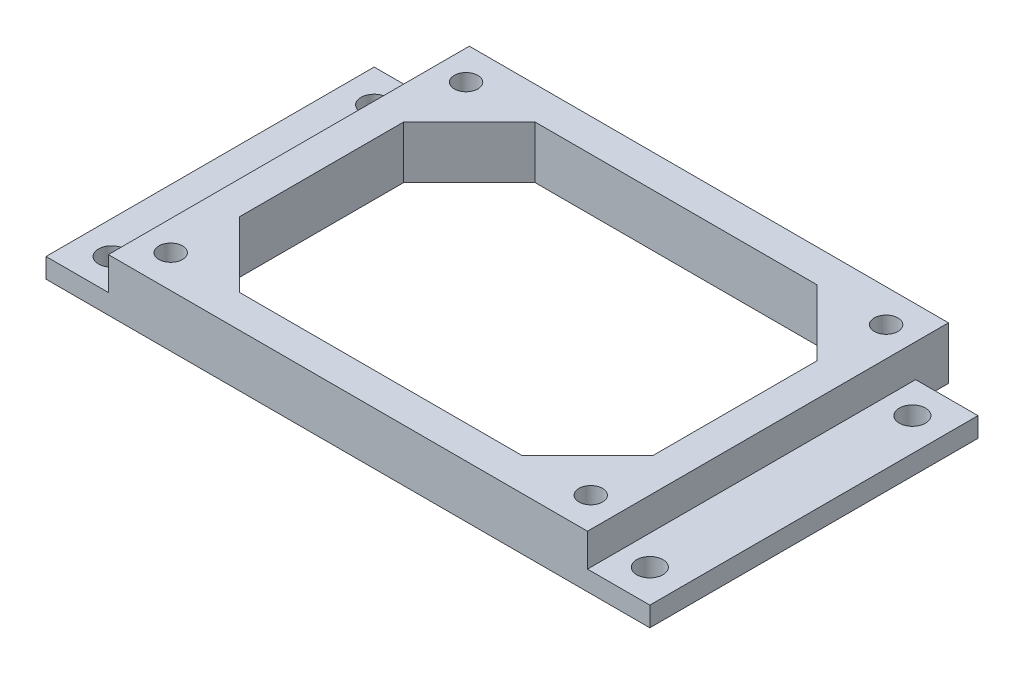
ISO-10303-21;
HEADER;
FILE_DESCRIPTION(('STEP AP214'),'2;1');
FILE_NAME('part.step','',(''),(''),'','','');
FILE_SCHEMA(('AUTOMOTIVE_DESIGN { 1 0 10303 214 1 1 1 1 }'));
ENDSEC;
DATA;
#1=APPLICATION_CONTEXT('core data for automotive mechanical design processes');
#2=APPLICATION_PROTOCOL_DEFINITION('international standard','automotive_design',2000,#1);
#3=PRODUCT_CONTEXT('',#1,'mechanical');
#4=PRODUCT('Part','Part','',(#3));
#5=PRODUCT_RELATED_PRODUCT_CATEGORY('part','',(#4));
#6=PRODUCT_DEFINITION_FORMATION('','',#4);
#7=PRODUCT_DEFINITION_CONTEXT('part definition',#1,'design');
#8=PRODUCT_DEFINITION('design','',#6,#7);
#9=PRODUCT_DEFINITION_SHAPE('','',#8);
#10=(LENGTH_UNIT() NAMED_UNIT(*) SI_UNIT(.MILLI.,.METRE.));
#11=(NAMED_UNIT(*) PLANE_ANGLE_UNIT() SI_UNIT($,.RADIAN.));
#12=(NAMED_UNIT(*) SI_UNIT($,.STERADIAN.) SOLID_ANGLE_UNIT());
#13=UNCERTAINTY_MEASURE_WITH_UNIT(LENGTH_MEASURE(1.E-05),#10,'distance_accuracy_value','');
#14=(GEOMETRIC_REPRESENTATION_CONTEXT(3) GLOBAL_UNCERTAINTY_ASSIGNED_CONTEXT((#13)) GLOBAL_UNIT_ASSIGNED_CONTEXT((#10,
#11,#12)) REPRESENTATION_CONTEXT('',''));
#15=CARTESIAN_POINT('',(0.,0.,0.));
#16=DIRECTION('',(0.,0.,1.));
#17=DIRECTION('',(1.,0.,0.));
#18=AXIS2_PLACEMENT_3D('',#15,#16,#17);
#19=CARTESIAN_POINT('',(-36.5,5.,-25.));
#20=DIRECTION('',(0.,0.,1.));
#21=DIRECTION('',(1.,0.,0.));
#22=AXIS2_PLACEMENT_3D('',#19,#20,#21);
#23=PLANE('',#22);
#24=DIRECTION('',(0.,-1.,0.));
#25=VECTOR('',#24,1.);
#26=CARTESIAN_POINT('',(36.5,5.,-25.));
#27=LINE('',#26,#25);
#28=CARTESIAN_POINT('',(36.5,0.,-25.));
#29=VERTEX_POINT('',#28);
#30=CARTESIAN_POINT('',(36.5,-3.,-25.));
#31=VERTEX_POINT('',#30);
#32=EDGE_CURVE('E11',#29,#31,#27,.T.);
#33=ORIENTED_EDGE('',*,*,#32,.F.);
#34=DIRECTION('',(1.,0.,0.));
#35=VECTOR('',#34,1.);
#36=CARTESIAN_POINT('',(-46.,0.,-25.));
#37=LINE('',#36,#35);
#38=CARTESIAN_POINT('',(46.,0.,-25.));
#39=VERTEX_POINT('',#38);
#40=EDGE_CURVE('E350',#29,#39,#37,.T.);
#41=ORIENTED_EDGE('',*,*,#40,.T.);
#42=DIRECTION('',(0.,1.,0.));
#43=VECTOR('',#42,1.);
#44=CARTESIAN_POINT('',(46.,-3.,-25.));
#45=LINE('',#44,#43);
#46=CARTESIAN_POINT('',(46.,-3.,-25.));
#47=VERTEX_POINT('',#46);
#48=EDGE_CURVE('E337',#47,#39,#45,.T.);
#49=ORIENTED_EDGE('',*,*,#48,.F.);
#50=DIRECTION('',(1.,0.,0.));
#51=VECTOR('',#50,1.);
#52=CARTESIAN_POINT('',(-46.,-3.,-25.));
#53=LINE('',#52,#51);
#54=EDGE_CURVE('E332',#31,#47,#53,.T.);
#55=ORIENTED_EDGE('',*,*,#54,.F.);
#56=EDGE_LOOP('',(#33,#41,#49,#55));
#57=FACE_BOUND('',#56,.T.);
#58=ADVANCED_FACE('F38',(#57),#23,.F.);
#59=DIRECTION('',(0.,1.,0.));
#60=VECTOR('',#59,1.);
#61=CARTESIAN_POINT('',(-36.5,5.,-25.));
#62=LINE('',#61,#60);
#63=CARTESIAN_POINT('',(-36.5,-3.,-25.));
#64=VERTEX_POINT('',#63);
#65=CARTESIAN_POINT('',(-36.5,0.,-25.));
#66=VERTEX_POINT('',#65);
#67=EDGE_CURVE('E281',#64,#66,#62,.T.);
#68=ORIENTED_EDGE('',*,*,#67,.F.);
#69=CARTESIAN_POINT('',(-46.,-3.,-25.));
#70=VERTEX_POINT('',#69);
#71=EDGE_CURVE('E333',#70,#64,#53,.T.);
#72=ORIENTED_EDGE('',*,*,#71,.F.);
#73=DIRECTION('',(0.,1.,0.));
#74=VECTOR('',#73,1.);
#75=CARTESIAN_POINT('',(-46.,-3.,-25.));
#76=LINE('',#75,#74);
#77=CARTESIAN_POINT('',(-46.,0.,-25.));
#78=VERTEX_POINT('',#77);
#79=EDGE_CURVE('E357',#70,#78,#76,.T.);
#80=ORIENTED_EDGE('',*,*,#79,.T.);
#81=EDGE_CURVE('E326',#78,#66,#37,.T.);
#82=ORIENTED_EDGE('',*,*,#81,.T.);
#83=EDGE_LOOP('',(#68,#72,#80,#82));
#84=FACE_BOUND('',#83,.T.);
#85=ADVANCED_FACE('F432',(#84),#23,.F.);
#86=CARTESIAN_POINT('',(36.5,5.,25.));
#87=DIRECTION('',(-1.,0.,0.));
#88=DIRECTION('',(0.,0.,1.));
#89=AXIS2_PLACEMENT_3D('',#86,#87,#88);
#90=PLANE('',#89);
#91=DIRECTION('',(0.,0.,-1.));
#92=VECTOR('',#91,1.);
#93=CARTESIAN_POINT('',(36.5,0.,25.));
#94=LINE('',#93,#92);
#95=CARTESIAN_POINT('',(36.5,0.,25.));
#96=VERTEX_POINT('',#95);
#97=EDGE_CURVE('E369',#96,#29,#94,.T.);
#98=ORIENTED_EDGE('',*,*,#97,.T.);
#99=ORIENTED_EDGE('',*,*,#32,.T.);
#100=DIRECTION('',(0.,0.,1.));
#101=VECTOR('',#100,1.);
#102=CARTESIAN_POINT('',(36.5,-3.,-30.));
#103=LINE('',#102,#101);
#104=CARTESIAN_POINT('',(36.5,-3.,-30.));
#105=VERTEX_POINT('',#104);
#106=EDGE_CURVE('E297',#105,#31,#103,.T.);
#107=ORIENTED_EDGE('',*,*,#106,.F.);
#108=DIRECTION('',(0.,-1.,0.));
#109=VECTOR('',#108,1.);
#110=CARTESIAN_POINT('',(36.5,5.,-30.));
#111=LINE('',#110,#109);
#112=CARTESIAN_POINT('',(36.5,5.,-30.));
#113=VERTEX_POINT('',#112);
#114=EDGE_CURVE('E276',#113,#105,#111,.T.);
#115=ORIENTED_EDGE('',*,*,#114,.F.);
#116=DIRECTION('',(0.,0.,-1.));
#117=VECTOR('',#116,1.);
#118=CARTESIAN_POINT('',(36.5,5.,25.));
#119=LINE('',#118,#117);
#120=CARTESIAN_POINT('',(36.5,5.,25.));
#121=VERTEX_POINT('',#120);
#122=EDGE_CURVE('E370',#121,#113,#119,.T.);
#123=ORIENTED_EDGE('',*,*,#122,.F.);
#124=DIRECTION('',(0.,-1.,0.));
#125=VECTOR('',#124,1.);
#126=CARTESIAN_POINT('',(36.5,5.,25.));
#127=LINE('',#126,#125);
#128=EDGE_CURVE('E380',#121,#96,#127,.T.);
#129=ORIENTED_EDGE('',*,*,#128,.T.);
#130=EDGE_LOOP('',(#98,#99,#107,#115,#123,#129));
#131=FACE_BOUND('',#130,.T.);
#132=ADVANCED_FACE('F40',(#131),#90,.F.);
#133=CARTESIAN_POINT('',(-36.5,5.,25.));
#134=DIRECTION('',(1.,0.,0.));
#135=DIRECTION('',(0.,0.,-1.));
#136=AXIS2_PLACEMENT_3D('',#133,#134,#135);
#137=PLANE('',#136);
#138=DIRECTION('',(0.,0.,1.));
#139=VECTOR('',#138,1.);
#140=CARTESIAN_POINT('',(-36.5,0.,25.));
#141=LINE('',#140,#139);
#142=CARTESIAN_POINT('',(-36.5,0.,25.));
#143=VERTEX_POINT('',#142);
#144=EDGE_CURVE('E374',#66,#143,#141,.T.);
#145=ORIENTED_EDGE('',*,*,#144,.T.);
#146=DIRECTION('',(0.,-1.,0.));
#147=VECTOR('',#146,1.);
#148=CARTESIAN_POINT('',(-36.5,5.,25.));
#149=LINE('',#148,#147);
#150=CARTESIAN_POINT('',(-36.5,5.,25.));
#151=VERTEX_POINT('',#150);
#152=EDGE_CURVE('E48',#151,#143,#149,.T.);
#153=ORIENTED_EDGE('',*,*,#152,.F.);
#154=DIRECTION('',(0.,0.,1.));
#155=VECTOR('',#154,1.);
#156=CARTESIAN_POINT('',(-36.5,5.,25.));
#157=LINE('',#156,#155);
#158=CARTESIAN_POINT('',(-36.5,5.,-30.));
#159=VERTEX_POINT('',#158);
#160=EDGE_CURVE('E373',#159,#151,#157,.T.);
#161=ORIENTED_EDGE('',*,*,#160,.F.);
#162=DIRECTION('',(0.,1.,0.));
#163=VECTOR('',#162,1.);
#164=CARTESIAN_POINT('',(-36.5,5.,-30.));
#165=LINE('',#164,#163);
#166=CARTESIAN_POINT('',(-36.5,-3.,-30.));
#167=VERTEX_POINT('',#166);
#168=EDGE_CURVE('E284',#167,#159,#165,.T.);
#169=ORIENTED_EDGE('',*,*,#168,.F.);
#170=DIRECTION('',(0.,0.,1.));
#171=VECTOR('',#170,1.);
#172=CARTESIAN_POINT('',(-36.5,-3.,-30.));
#173=LINE('',#172,#171);
#174=EDGE_CURVE('E291',#167,#64,#173,.T.);
#175=ORIENTED_EDGE('',*,*,#174,.T.);
#176=ORIENTED_EDGE('',*,*,#67,.T.);
#177=EDGE_LOOP('',(#145,#153,#161,#169,#175,#176));
#178=FACE_BOUND('',#177,.T.);
#179=ADVANCED_FACE('F439',(#178),#137,.F.);
#180=CARTESIAN_POINT('',(-36.5,5.,25.));
#181=DIRECTION('',(0.,0.,-1.));
#182=DIRECTION('',(-1.,0.,0.));
#183=AXIS2_PLACEMENT_3D('',#180,#181,#182);
#184=PLANE('',#183);
#185=ORIENTED_EDGE('',*,*,#152,.T.);
#186=DIRECTION('',(-1.,0.,0.));
#187=VECTOR('',#186,1.);
#188=CARTESIAN_POINT('',(-46.,0.,25.));
#189=LINE('',#188,#187);
#190=CARTESIAN_POINT('',(-46.,0.,25.));
#191=VERTEX_POINT('',#190);
#192=EDGE_CURVE('E342',#143,#191,#189,.T.);
#193=ORIENTED_EDGE('',*,*,#192,.T.);
#194=DIRECTION('',(0.,1.,0.));
#195=VECTOR('',#194,1.);
#196=CARTESIAN_POINT('',(-46.,-3.,25.));
#197=LINE('',#196,#195);
#198=CARTESIAN_POINT('',(-46.,-3.,25.));
#199=VERTEX_POINT('',#198);
#200=EDGE_CURVE('E361',#199,#191,#197,.T.);
#201=ORIENTED_EDGE('',*,*,#200,.F.);
#202=DIRECTION('',(-1.,0.,0.));
#203=VECTOR('',#202,1.);
#204=CARTESIAN_POINT('',(-46.,-3.,25.));
#205=LINE('',#204,#203);
#206=CARTESIAN_POINT('',(46.,-3.,25.));
#207=VERTEX_POINT('',#206);
#208=EDGE_CURVE('E325',#207,#199,#205,.T.);
#209=ORIENTED_EDGE('',*,*,#208,.F.);
#210=DIRECTION('',(0.,1.,0.));
#211=VECTOR('',#210,1.);
#212=CARTESIAN_POINT('',(46.,-3.,25.));
#213=LINE('',#212,#211);
#214=CARTESIAN_POINT('',(46.,0.,25.));
#215=VERTEX_POINT('',#214);
#216=EDGE_CURVE('E365',#207,#215,#213,.T.);
#217=ORIENTED_EDGE('',*,*,#216,.T.);
#218=EDGE_CURVE('E343',#215,#96,#189,.T.);
#219=ORIENTED_EDGE('',*,*,#218,.T.);
#220=ORIENTED_EDGE('',*,*,#128,.F.);
#221=DIRECTION('',(1.,0.,0.));
#222=VECTOR('',#221,1.);
#223=CARTESIAN_POINT('',(-36.5,5.,25.));
#224=LINE('',#223,#222);
#225=EDGE_CURVE('E377',#151,#121,#224,.T.);
#226=ORIENTED_EDGE('',*,*,#225,.F.);
#227=EDGE_LOOP('',(#185,#193,#201,#209,#217,#219,#220,#226));
#228=FACE_BOUND('',#227,.T.);
#229=ADVANCED_FACE('F442',(#228),#184,.F.);
#230=CARTESIAN_POINT('',(0.,5.,0.));
#231=DIRECTION('',(0.,-1.,0.));
#232=DIRECTION('',(0.,0.,-1.));
#233=AXIS2_PLACEMENT_3D('',#230,#231,#232);
#234=PLANE('',#233);
#235=DIRECTION('',(-0.707106781186548,0.,-0.707106781186547));
#236=VECTOR('',#235,1.);
#237=CARTESIAN_POINT('',(31.5,5.,-15.));
#238=LINE('',#237,#236);
#239=CARTESIAN_POINT('',(31.5,5.,-15.));
#240=VERTEX_POINT('',#239);
#241=CARTESIAN_POINT('',(21.5,5.,-25.));
#242=VERTEX_POINT('',#241);
#243=EDGE_CURVE('E215',#240,#242,#238,.T.);
#244=ORIENTED_EDGE('',*,*,#243,.F.);
#245=DIRECTION('',(0.,0.,-1.));
#246=VECTOR('',#245,1.);
#247=CARTESIAN_POINT('',(31.5,5.,10.));
#248=LINE('',#247,#246);
#249=CARTESIAN_POINT('',(31.5,5.,10.));
#250=VERTEX_POINT('',#249);
#251=EDGE_CURVE('E56',#250,#240,#248,.T.);
#252=ORIENTED_EDGE('',*,*,#251,.F.);
#253=DIRECTION('',(0.707106781186548,0.,-0.707106781186547));
#254=VECTOR('',#253,1.);
#255=CARTESIAN_POINT('',(21.5,5.,20.));
#256=LINE('',#255,#254);
#257=CARTESIAN_POINT('',(21.5,5.,20.));
#258=VERTEX_POINT('',#257);
#259=EDGE_CURVE('E187',#258,#250,#256,.T.);
#260=ORIENTED_EDGE('',*,*,#259,.F.);
#261=DIRECTION('',(1.,0.,0.));
#262=VECTOR('',#261,1.);
#263=CARTESIAN_POINT('',(-21.5,5.,20.));
#264=LINE('',#263,#262);
#265=CARTESIAN_POINT('',(-21.5,5.,20.));
#266=VERTEX_POINT('',#265);
#267=EDGE_CURVE('E191',#266,#258,#264,.T.);
#268=ORIENTED_EDGE('',*,*,#267,.F.);
#269=DIRECTION('',(0.707106781186548,0.,0.707106781186547));
#270=VECTOR('',#269,1.);
#271=CARTESIAN_POINT('',(-31.5,5.,10.));
#272=LINE('',#271,#270);
#273=CARTESIAN_POINT('',(-31.5,5.,10.));
#274=VERTEX_POINT('',#273);
#275=EDGE_CURVE('E230',#274,#266,#272,.T.);
#276=ORIENTED_EDGE('',*,*,#275,.F.);
#277=DIRECTION('',(0.,0.,1.));
#278=VECTOR('',#277,1.);
#279=CARTESIAN_POINT('',(-31.5,5.,-15.));
#280=LINE('',#279,#278);
#281=CARTESIAN_POINT('',(-31.5,5.,-15.));
#282=VERTEX_POINT('',#281);
#283=EDGE_CURVE('E226',#282,#274,#280,.T.);
#284=ORIENTED_EDGE('',*,*,#283,.F.);
#285=DIRECTION('',(-0.707106781186548,0.,0.707106781186547));
#286=VECTOR('',#285,1.);
#287=CARTESIAN_POINT('',(-21.5,5.,-25.));
#288=LINE('',#287,#286);
#289=CARTESIAN_POINT('',(-21.5,5.,-25.));
#290=VERTEX_POINT('',#289);
#291=EDGE_CURVE('E222',#290,#282,#288,.T.);
#292=ORIENTED_EDGE('',*,*,#291,.F.);
#293=DIRECTION('',(-1.,0.,0.));
#294=VECTOR('',#293,1.);
#295=CARTESIAN_POINT('',(21.5,5.,-25.));
#296=LINE('',#295,#294);
#297=EDGE_CURVE('E218',#242,#290,#296,.T.);
#298=ORIENTED_EDGE('',*,*,#297,.F.);
#299=EDGE_LOOP('',(#244,#252,#260,#268,#276,#284,#292,#298));
#300=FACE_BOUND('',#299,.T.);
#301=CARTESIAN_POINT('',(32.,5.,20.));
#302=DIRECTION('',(0.,1.,0.));
#303=DIRECTION('',(0.,0.,1.));
#304=AXIS2_PLACEMENT_3D('',#301,#302,#303);
#305=CIRCLE('',#304,1.8);
#306=CARTESIAN_POINT('',(32.,5.,21.8));
#307=VERTEX_POINT('',#306);
#308=EDGE_CURVE('E240',#307,#307,#305,.T.);
#309=ORIENTED_EDGE('',*,*,#308,.F.);
#310=EDGE_LOOP('',(#309));
#311=FACE_BOUND('',#310,.T.);
#312=CARTESIAN_POINT('',(-32.,5.,-25.));
#313=DIRECTION('',(0.,1.,0.));
#314=DIRECTION('',(0.,0.,1.));
#315=AXIS2_PLACEMENT_3D('',#312,#313,#314);
#316=CIRCLE('',#315,1.8);
#317=CARTESIAN_POINT('',(-32.,5.,-23.2));
#318=VERTEX_POINT('',#317);
#319=EDGE_CURVE('E261',#318,#318,#316,.T.);
#320=ORIENTED_EDGE('',*,*,#319,.F.);
#321=EDGE_LOOP('',(#320));
#322=FACE_BOUND('',#321,.T.);
#323=CARTESIAN_POINT('',(32.,5.,-25.));
#324=DIRECTION('',(0.,1.,0.));
#325=DIRECTION('',(0.,0.,1.));
#326=AXIS2_PLACEMENT_3D('',#323,#324,#325);
#327=CIRCLE('',#326,1.8);
#328=CARTESIAN_POINT('',(32.,5.,-23.2));
#329=VERTEX_POINT('',#328);
#330=EDGE_CURVE('E266',#329,#329,#327,.T.);
#331=ORIENTED_EDGE('',*,*,#330,.F.);
#332=EDGE_LOOP('',(#331));
#333=FACE_BOUND('',#332,.T.);
#334=CARTESIAN_POINT('',(-32.,5.,20.));
#335=DIRECTION('',(0.,1.,0.));
#336=DIRECTION('',(0.,0.,1.));
#337=AXIS2_PLACEMENT_3D('',#334,#335,#336);
#338=CIRCLE('',#337,1.8);
#339=CARTESIAN_POINT('',(-32.,5.,21.8));
#340=VERTEX_POINT('',#339);
#341=EDGE_CURVE('E271',#340,#340,#338,.T.);
#342=ORIENTED_EDGE('',*,*,#341,.F.);
#343=EDGE_LOOP('',(#342));
#344=FACE_BOUND('',#343,.T.);
#345=ORIENTED_EDGE('',*,*,#122,.T.);
#346=DIRECTION('',(1.,0.,0.));
#347=VECTOR('',#346,1.);
#348=CARTESIAN_POINT('',(36.5,5.,-30.));
#349=LINE('',#348,#347);
#350=EDGE_CURVE('E288',#159,#113,#349,.T.);
#351=ORIENTED_EDGE('',*,*,#350,.F.);
#352=ORIENTED_EDGE('',*,*,#160,.T.);
#353=ORIENTED_EDGE('',*,*,#225,.T.);
#354=EDGE_LOOP('',(#345,#351,#352,#353));
#355=FACE_BOUND('',#354,.T.);
#356=ADVANCED_FACE('F446',(#300,#311,#322,#333,#344,#355),#234,.F.);
#357=CARTESIAN_POINT('',(0.,0.,0.));
#358=DIRECTION('',(0.,1.,0.));
#359=DIRECTION('',(0.,0.,1.));
#360=AXIS2_PLACEMENT_3D('',#357,#358,#359);
#361=PLANE('',#360);
#362=CARTESIAN_POINT('',(41.,0.,-20.));
#363=DIRECTION('',(0.,1.,0.));
#364=DIRECTION('',(0.,0.,1.));
#365=AXIS2_PLACEMENT_3D('',#362,#363,#364);
#366=CIRCLE('',#365,2.);
#367=CARTESIAN_POINT('',(41.,0.,-18.));
#368=VERTEX_POINT('',#367);
#369=EDGE_CURVE('E311',#368,#368,#366,.T.);
#370=ORIENTED_EDGE('',*,*,#369,.F.);
#371=EDGE_LOOP('',(#370));
#372=FACE_BOUND('',#371,.T.);
#373=CARTESIAN_POINT('',(41.,0.,20.));
#374=DIRECTION('',(0.,1.,0.));
#375=DIRECTION('',(0.,0.,1.));
#376=AXIS2_PLACEMENT_3D('',#373,#374,#375);
#377=CIRCLE('',#376,2.);
#378=CARTESIAN_POINT('',(41.,0.,22.));
#379=VERTEX_POINT('',#378);
#380=EDGE_CURVE('E316',#379,#379,#377,.T.);
#381=ORIENTED_EDGE('',*,*,#380,.F.);
#382=EDGE_LOOP('',(#381));
#383=FACE_BOUND('',#382,.T.);
#384=ORIENTED_EDGE('',*,*,#97,.F.);
#385=ORIENTED_EDGE('',*,*,#218,.F.);
#386=DIRECTION('',(0.,0.,1.));
#387=VECTOR('',#386,1.);
#388=CARTESIAN_POINT('',(46.,0.,-25.));
#389=LINE('',#388,#387);
#390=EDGE_CURVE('E338',#39,#215,#389,.T.);
#391=ORIENTED_EDGE('',*,*,#390,.F.);
#392=ORIENTED_EDGE('',*,*,#40,.F.);
#393=EDGE_LOOP('',(#384,#385,#391,#392));
#394=FACE_BOUND('',#393,.T.);
#395=ADVANCED_FACE('F450',(#372,#383,#394),#361,.T.);
#396=CARTESIAN_POINT('',(-41.,0.,-20.));
#397=DIRECTION('',(0.,1.,0.));
#398=DIRECTION('',(0.,0.,1.));
#399=AXIS2_PLACEMENT_3D('',#396,#397,#398);
#400=CIRCLE('',#399,2.);
#401=CARTESIAN_POINT('',(-41.,0.,-18.));
#402=VERTEX_POINT('',#401);
#403=EDGE_CURVE('E301',#402,#402,#400,.T.);
#404=ORIENTED_EDGE('',*,*,#403,.F.);
#405=EDGE_LOOP('',(#404));
#406=FACE_BOUND('',#405,.T.);
#407=CARTESIAN_POINT('',(-41.,0.,20.));
#408=DIRECTION('',(0.,1.,0.));
#409=DIRECTION('',(0.,0.,1.));
#410=AXIS2_PLACEMENT_3D('',#407,#408,#409);
#411=CIRCLE('',#410,2.);
#412=CARTESIAN_POINT('',(-41.,0.,22.));
#413=VERTEX_POINT('',#412);
#414=EDGE_CURVE('E306',#413,#413,#411,.T.);
#415=ORIENTED_EDGE('',*,*,#414,.F.);
#416=EDGE_LOOP('',(#415));
#417=FACE_BOUND('',#416,.T.);
#418=ORIENTED_EDGE('',*,*,#144,.F.);
#419=ORIENTED_EDGE('',*,*,#81,.F.);
#420=DIRECTION('',(0.,0.,-1.));
#421=VECTOR('',#420,1.);
#422=CARTESIAN_POINT('',(-46.,0.,-25.));
#423=LINE('',#422,#421);
#424=EDGE_CURVE('E347',#191,#78,#423,.T.);
#425=ORIENTED_EDGE('',*,*,#424,.F.);
#426=ORIENTED_EDGE('',*,*,#192,.F.);
#427=EDGE_LOOP('',(#418,#419,#425,#426));
#428=FACE_BOUND('',#427,.T.);
#429=ADVANCED_FACE('F456',(#406,#417,#428),#361,.T.);
#430=CARTESIAN_POINT('',(46.,-3.,-25.));
#431=DIRECTION('',(-1.,0.,0.));
#432=DIRECTION('',(0.,0.,1.));
#433=AXIS2_PLACEMENT_3D('',#430,#431,#432);
#434=PLANE('',#433);
#435=ORIENTED_EDGE('',*,*,#390,.T.);
#436=ORIENTED_EDGE('',*,*,#216,.F.);
#437=DIRECTION('',(0.,0.,1.));
#438=VECTOR('',#437,1.);
#439=CARTESIAN_POINT('',(46.,-3.,-25.));
#440=LINE('',#439,#438);
#441=EDGE_CURVE('E321',#47,#207,#440,.T.);
#442=ORIENTED_EDGE('',*,*,#441,.F.);
#443=ORIENTED_EDGE('',*,*,#48,.T.);
#444=EDGE_LOOP('',(#435,#436,#442,#443));
#445=FACE_BOUND('',#444,.T.);
#446=ADVANCED_FACE('F452',(#445),#434,.F.);
#447=CARTESIAN_POINT('',(-46.,-3.,-25.));
#448=DIRECTION('',(1.,0.,0.));
#449=DIRECTION('',(0.,0.,-1.));
#450=AXIS2_PLACEMENT_3D('',#447,#448,#449);
#451=PLANE('',#450);
#452=ORIENTED_EDGE('',*,*,#424,.T.);
#453=ORIENTED_EDGE('',*,*,#79,.F.);
#454=DIRECTION('',(0.,0.,-1.));
#455=VECTOR('',#454,1.);
#456=CARTESIAN_POINT('',(-46.,-3.,-25.));
#457=LINE('',#456,#455);
#458=EDGE_CURVE('E329',#199,#70,#457,.T.);
#459=ORIENTED_EDGE('',*,*,#458,.F.);
#460=ORIENTED_EDGE('',*,*,#200,.T.);
#461=EDGE_LOOP('',(#452,#453,#459,#460));
#462=FACE_BOUND('',#461,.T.);
#463=ADVANCED_FACE('F455',(#462),#451,.F.);
#464=CARTESIAN_POINT('',(0.,-3.,0.));
#465=DIRECTION('',(0.,1.,0.));
#466=DIRECTION('',(0.,0.,1.));
#467=AXIS2_PLACEMENT_3D('',#464,#465,#466);
#468=PLANE('',#467);
#469=DIRECTION('',(0.707106781186548,0.,-0.707106781186547));
#470=VECTOR('',#469,1.);
#471=CARTESIAN_POINT('',(21.5,-3.,20.));
#472=LINE('',#471,#470);
#473=CARTESIAN_POINT('',(21.5,-3.,20.));
#474=VERTEX_POINT('',#473);
#475=CARTESIAN_POINT('',(31.5,-3.,10.));
#476=VERTEX_POINT('',#475);
#477=EDGE_CURVE('E174',#474,#476,#472,.T.);
#478=ORIENTED_EDGE('',*,*,#477,.T.);
#479=DIRECTION('',(0.,0.,-1.));
#480=VECTOR('',#479,1.);
#481=CARTESIAN_POINT('',(31.5,-3.,10.));
#482=LINE('',#481,#480);
#483=CARTESIAN_POINT('',(31.5,-3.,-15.));
#484=VERTEX_POINT('',#483);
#485=EDGE_CURVE('E167',#476,#484,#482,.T.);
#486=ORIENTED_EDGE('',*,*,#485,.T.);
#487=DIRECTION('',(-0.707106781186548,0.,-0.707106781186547));
#488=VECTOR('',#487,1.);
#489=CARTESIAN_POINT('',(31.5,-3.,-15.));
#490=LINE('',#489,#488);
#491=CARTESIAN_POINT('',(21.5,-3.,-25.));
#492=VERTEX_POINT('',#491);
#493=EDGE_CURVE('E177',#484,#492,#490,.T.);
#494=ORIENTED_EDGE('',*,*,#493,.T.);
#495=DIRECTION('',(-1.,0.,0.));
#496=VECTOR('',#495,1.);
#497=CARTESIAN_POINT('',(21.5,-3.,-25.));
#498=LINE('',#497,#496);
#499=CARTESIAN_POINT('',(-21.5,-3.,-25.));
#500=VERTEX_POINT('',#499);
#501=EDGE_CURVE('E64',#492,#500,#498,.T.);
#502=ORIENTED_EDGE('',*,*,#501,.T.);
#503=DIRECTION('',(-0.707106781186548,0.,0.707106781186547));
#504=VECTOR('',#503,1.);
#505=CARTESIAN_POINT('',(-21.5,-3.,-25.));
#506=LINE('',#505,#504);
#507=CARTESIAN_POINT('',(-31.5,-3.,-15.));
#508=VERTEX_POINT('',#507);
#509=EDGE_CURVE('E196',#500,#508,#506,.T.);
#510=ORIENTED_EDGE('',*,*,#509,.T.);
#511=DIRECTION('',(0.,0.,1.));
#512=VECTOR('',#511,1.);
#513=CARTESIAN_POINT('',(-31.5,-3.,-15.));
#514=LINE('',#513,#512);
#515=CARTESIAN_POINT('',(-31.5,-3.,10.));
#516=VERTEX_POINT('',#515);
#517=EDGE_CURVE('E200',#508,#516,#514,.T.);
#518=ORIENTED_EDGE('',*,*,#517,.T.);
#519=DIRECTION('',(0.707106781186548,0.,0.707106781186547));
#520=VECTOR('',#519,1.);
#521=CARTESIAN_POINT('',(-31.5,-3.,10.));
#522=LINE('',#521,#520);
#523=CARTESIAN_POINT('',(-21.5,-3.,20.));
#524=VERTEX_POINT('',#523);
#525=EDGE_CURVE('E204',#516,#524,#522,.T.);
#526=ORIENTED_EDGE('',*,*,#525,.T.);
#527=DIRECTION('',(1.,0.,0.));
#528=VECTOR('',#527,1.);
#529=CARTESIAN_POINT('',(-21.5,-3.,20.));
#530=LINE('',#529,#528);
#531=EDGE_CURVE('E208',#524,#474,#530,.T.);
#532=ORIENTED_EDGE('',*,*,#531,.T.);
#533=EDGE_LOOP('',(#478,#486,#494,#502,#510,#518,#526,#532));
#534=FACE_BOUND('',#533,.T.);
#535=CARTESIAN_POINT('',(32.,-3.,20.));
#536=DIRECTION('',(0.,1.,0.));
#537=DIRECTION('',(0.,0.,1.));
#538=AXIS2_PLACEMENT_3D('',#535,#536,#537);
#539=CIRCLE('',#538,1.8);
#540=CARTESIAN_POINT('',(32.,-3.,21.8));
#541=VERTEX_POINT('',#540);
#542=EDGE_CURVE('E42',#541,#541,#539,.T.);
#543=ORIENTED_EDGE('',*,*,#542,.T.);
#544=EDGE_LOOP('',(#543));
#545=FACE_BOUND('',#544,.T.);
#546=CARTESIAN_POINT('',(-32.,-3.,-25.));
#547=DIRECTION('',(0.,1.,0.));
#548=DIRECTION('',(0.,0.,1.));
#549=AXIS2_PLACEMENT_3D('',#546,#547,#548);
#550=CIRCLE('',#549,1.8);
#551=CARTESIAN_POINT('',(-32.,-3.,-23.2));
#552=VERTEX_POINT('',#551);
#553=EDGE_CURVE('E265',#552,#552,#550,.T.);
#554=ORIENTED_EDGE('',*,*,#553,.T.);
#555=EDGE_LOOP('',(#554));
#556=FACE_BOUND('',#555,.T.);
#557=CARTESIAN_POINT('',(32.,-3.,-25.));
#558=DIRECTION('',(0.,1.,0.));
#559=DIRECTION('',(0.,0.,1.));
#560=AXIS2_PLACEMENT_3D('',#557,#558,#559);
#561=CIRCLE('',#560,1.8);
#562=CARTESIAN_POINT('',(32.,-3.,-23.2));
#563=VERTEX_POINT('',#562);
#564=EDGE_CURVE('E270',#563,#563,#561,.T.);
#565=ORIENTED_EDGE('',*,*,#564,.T.);
#566=EDGE_LOOP('',(#565));
#567=FACE_BOUND('',#566,.T.);
#568=CARTESIAN_POINT('',(-32.,-3.,20.));
#569=DIRECTION('',(0.,1.,0.));
#570=DIRECTION('',(0.,0.,1.));
#571=AXIS2_PLACEMENT_3D('',#568,#569,#570);
#572=CIRCLE('',#571,1.8);
#573=CARTESIAN_POINT('',(-32.,-3.,21.8));
#574=VERTEX_POINT('',#573);
#575=EDGE_CURVE('E275',#574,#574,#572,.T.);
#576=ORIENTED_EDGE('',*,*,#575,.T.);
#577=EDGE_LOOP('',(#576));
#578=FACE_BOUND('',#577,.T.);
#579=CARTESIAN_POINT('',(-41.,-3.,-20.));
#580=DIRECTION('',(0.,1.,0.));
#581=DIRECTION('',(0.,0.,1.));
#582=AXIS2_PLACEMENT_3D('',#579,#580,#581);
#583=CIRCLE('',#582,2.);
#584=CARTESIAN_POINT('',(-41.,-3.,-18.));
#585=VERTEX_POINT('',#584);
#586=EDGE_CURVE('E305',#585,#585,#583,.T.);
#587=ORIENTED_EDGE('',*,*,#586,.T.);
#588=EDGE_LOOP('',(#587));
#589=FACE_BOUND('',#588,.T.);
#590=CARTESIAN_POINT('',(-41.,-3.,20.));
#591=DIRECTION('',(0.,1.,0.));
#592=DIRECTION('',(0.,0.,1.));
#593=AXIS2_PLACEMENT_3D('',#590,#591,#592);
#594=CIRCLE('',#593,2.);
#595=CARTESIAN_POINT('',(-41.,-3.,22.));
#596=VERTEX_POINT('',#595);
#597=EDGE_CURVE('E310',#596,#596,#594,.T.);
#598=ORIENTED_EDGE('',*,*,#597,.T.);
#599=EDGE_LOOP('',(#598));
#600=FACE_BOUND('',#599,.T.);
#601=CARTESIAN_POINT('',(41.,-3.,-20.));
#602=DIRECTION('',(0.,1.,0.));
#603=DIRECTION('',(0.,0.,1.));
#604=AXIS2_PLACEMENT_3D('',#601,#602,#603);
#605=CIRCLE('',#604,2.);
#606=CARTESIAN_POINT('',(41.,-3.,-18.));
#607=VERTEX_POINT('',#606);
#608=EDGE_CURVE('E315',#607,#607,#605,.T.);
#609=ORIENTED_EDGE('',*,*,#608,.T.);
#610=EDGE_LOOP('',(#609));
#611=FACE_BOUND('',#610,.T.);
#612=CARTESIAN_POINT('',(41.,-3.,20.));
#613=DIRECTION('',(0.,1.,0.));
#614=DIRECTION('',(0.,0.,1.));
#615=AXIS2_PLACEMENT_3D('',#612,#613,#614);
#616=CIRCLE('',#615,2.);
#617=CARTESIAN_POINT('',(41.,-3.,22.));
#618=VERTEX_POINT('',#617);
#619=EDGE_CURVE('E320',#618,#618,#616,.T.);
#620=ORIENTED_EDGE('',*,*,#619,.T.);
#621=EDGE_LOOP('',(#620));
#622=FACE_BOUND('',#621,.T.);
#623=ORIENTED_EDGE('',*,*,#441,.T.);
#624=ORIENTED_EDGE('',*,*,#208,.T.);
#625=ORIENTED_EDGE('',*,*,#458,.T.);
#626=ORIENTED_EDGE('',*,*,#71,.T.);
#627=ORIENTED_EDGE('',*,*,#174,.F.);
#628=DIRECTION('',(-1.,0.,0.));
#629=VECTOR('',#628,1.);
#630=CARTESIAN_POINT('',(36.5,-3.,-30.));
#631=LINE('',#630,#629);
#632=EDGE_CURVE('E280',#105,#167,#631,.T.);
#633=ORIENTED_EDGE('',*,*,#632,.F.);
#634=ORIENTED_EDGE('',*,*,#106,.T.);
#635=ORIENTED_EDGE('',*,*,#54,.T.);
#636=EDGE_LOOP('',(#623,#624,#625,#626,#627,#633,#634,#635));
#637=FACE_BOUND('',#636,.T.);
#638=ADVANCED_FACE('F182',(#534,#545,#556,#567,#578,#589,#600,#611,#622,#637),#468,.F.);
#639=CARTESIAN_POINT('',(41.,0.,20.));
#640=DIRECTION('',(0.,1.,0.));
#641=DIRECTION('',(0.,0.,1.));
#642=AXIS2_PLACEMENT_3D('',#639,#640,#641);
#643=CYLINDRICAL_SURFACE('',#642,2.);
#644=ORIENTED_EDGE('',*,*,#380,.T.);
#645=EDGE_LOOP('',(#644));
#646=FACE_BOUND('',#645,.T.);
#647=ORIENTED_EDGE('',*,*,#619,.F.);
#648=EDGE_LOOP('',(#647));
#649=FACE_BOUND('',#648,.T.);
#650=ADVANCED_FACE('F466',(#646,#649),#643,.F.);
#651=CARTESIAN_POINT('',(41.,0.,-20.));
#652=DIRECTION('',(0.,1.,0.));
#653=DIRECTION('',(0.,0.,1.));
#654=AXIS2_PLACEMENT_3D('',#651,#652,#653);
#655=CYLINDRICAL_SURFACE('',#654,2.);
#656=ORIENTED_EDGE('',*,*,#369,.T.);
#657=EDGE_LOOP('',(#656));
#658=FACE_BOUND('',#657,.T.);
#659=ORIENTED_EDGE('',*,*,#608,.F.);
#660=EDGE_LOOP('',(#659));
#661=FACE_BOUND('',#660,.T.);
#662=ADVANCED_FACE('F469',(#658,#661),#655,.F.);
#663=CARTESIAN_POINT('',(-41.,0.,20.));
#664=DIRECTION('',(0.,1.,0.));
#665=DIRECTION('',(0.,0.,1.));
#666=AXIS2_PLACEMENT_3D('',#663,#664,#665);
#667=CYLINDRICAL_SURFACE('',#666,2.);
#668=ORIENTED_EDGE('',*,*,#414,.T.);
#669=EDGE_LOOP('',(#668));
#670=FACE_BOUND('',#669,.T.);
#671=ORIENTED_EDGE('',*,*,#597,.F.);
#672=EDGE_LOOP('',(#671));
#673=FACE_BOUND('',#672,.T.);
#674=ADVANCED_FACE('F473',(#670,#673),#667,.F.);
#675=CARTESIAN_POINT('',(-41.,0.,-20.));
#676=DIRECTION('',(0.,1.,0.));
#677=DIRECTION('',(0.,0.,1.));
#678=AXIS2_PLACEMENT_3D('',#675,#676,#677);
#679=CYLINDRICAL_SURFACE('',#678,2.);
#680=ORIENTED_EDGE('',*,*,#403,.T.);
#681=EDGE_LOOP('',(#680));
#682=FACE_BOUND('',#681,.T.);
#683=ORIENTED_EDGE('',*,*,#586,.F.);
#684=EDGE_LOOP('',(#683));
#685=FACE_BOUND('',#684,.T.);
#686=ADVANCED_FACE('F477',(#682,#685),#679,.F.);
#687=CARTESIAN_POINT('',(0.,0.,-30.));
#688=DIRECTION('',(0.,0.,-1.));
#689=DIRECTION('',(-1.,0.,0.));
#690=AXIS2_PLACEMENT_3D('',#687,#688,#689);
#691=PLANE('',#690);
#692=ORIENTED_EDGE('',*,*,#114,.T.);
#693=ORIENTED_EDGE('',*,*,#632,.T.);
#694=ORIENTED_EDGE('',*,*,#168,.T.);
#695=ORIENTED_EDGE('',*,*,#350,.T.);
#696=EDGE_LOOP('',(#692,#693,#694,#695));
#697=FACE_BOUND('',#696,.T.);
#698=ADVANCED_FACE('F481',(#697),#691,.T.);
#699=CARTESIAN_POINT('',(-32.,5.,20.));
#700=DIRECTION('',(0.,1.,0.));
#701=DIRECTION('',(0.,0.,1.));
#702=AXIS2_PLACEMENT_3D('',#699,#700,#701);
#703=CYLINDRICAL_SURFACE('',#702,1.8);
#704=ORIENTED_EDGE('',*,*,#341,.T.);
#705=EDGE_LOOP('',(#704));
#706=FACE_BOUND('',#705,.T.);
#707=ORIENTED_EDGE('',*,*,#575,.F.);
#708=EDGE_LOOP('',(#707));
#709=FACE_BOUND('',#708,.T.);
#710=ADVANCED_FACE('F428',(#706,#709),#703,.F.);
#711=CARTESIAN_POINT('',(32.,5.,-25.));
#712=DIRECTION('',(0.,1.,0.));
#713=DIRECTION('',(0.,0.,1.));
#714=AXIS2_PLACEMENT_3D('',#711,#712,#713);
#715=CYLINDRICAL_SURFACE('',#714,1.8);
#716=ORIENTED_EDGE('',*,*,#330,.T.);
#717=EDGE_LOOP('',(#716));
#718=FACE_BOUND('',#717,.T.);
#719=ORIENTED_EDGE('',*,*,#564,.F.);
#720=EDGE_LOOP('',(#719));
#721=FACE_BOUND('',#720,.T.);
#722=ADVANCED_FACE('F419',(#718,#721),#715,.F.);
#723=CARTESIAN_POINT('',(-32.,5.,-25.));
#724=DIRECTION('',(0.,1.,0.));
#725=DIRECTION('',(0.,0.,1.));
#726=AXIS2_PLACEMENT_3D('',#723,#724,#725);
#727=CYLINDRICAL_SURFACE('',#726,1.8);
#728=ORIENTED_EDGE('',*,*,#319,.T.);
#729=EDGE_LOOP('',(#728));
#730=FACE_BOUND('',#729,.T.);
#731=ORIENTED_EDGE('',*,*,#553,.F.);
#732=EDGE_LOOP('',(#731));
#733=FACE_BOUND('',#732,.T.);
#734=ADVANCED_FACE('F416',(#730,#733),#727,.F.);
#735=CARTESIAN_POINT('',(32.,5.,20.));
#736=DIRECTION('',(0.,1.,0.));
#737=DIRECTION('',(0.,0.,1.));
#738=AXIS2_PLACEMENT_3D('',#735,#736,#737);
#739=CYLINDRICAL_SURFACE('',#738,1.8);
#740=ORIENTED_EDGE('',*,*,#308,.T.);
#741=EDGE_LOOP('',(#740));
#742=FACE_BOUND('',#741,.T.);
#743=ORIENTED_EDGE('',*,*,#542,.F.);
#744=EDGE_LOOP('',(#743));
#745=FACE_BOUND('',#744,.T.);
#746=ADVANCED_FACE('F418',(#742,#745),#739,.F.);
#747=CARTESIAN_POINT('',(31.5,-3.,10.));
#748=DIRECTION('',(1.,0.,0.));
#749=DIRECTION('',(0.,0.,-1.));
#750=AXIS2_PLACEMENT_3D('',#747,#748,#749);
#751=PLANE('',#750);
#752=ORIENTED_EDGE('',*,*,#251,.T.);
#753=DIRECTION('',(0.,1.,0.));
#754=VECTOR('',#753,1.);
#755=CARTESIAN_POINT('',(31.5,-3.,-15.));
#756=LINE('',#755,#754);
#757=EDGE_CURVE('E163',#484,#240,#756,.T.);
#758=ORIENTED_EDGE('',*,*,#757,.F.);
#759=ORIENTED_EDGE('',*,*,#485,.F.);
#760=DIRECTION('',(0.,1.,0.));
#761=VECTOR('',#760,1.);
#762=CARTESIAN_POINT('',(31.5,-3.,10.));
#763=LINE('',#762,#761);
#764=EDGE_CURVE('E237',#476,#250,#763,.T.);
#765=ORIENTED_EDGE('',*,*,#764,.T.);
#766=EDGE_LOOP('',(#752,#758,#759,#765));
#767=FACE_BOUND('',#766,.T.);
#768=ADVANCED_FACE('F165',(#767),#751,.F.);
#769=CARTESIAN_POINT('',(21.5,-3.,20.));
#770=DIRECTION('',(0.707106781186547,0.,0.707106781186548));
#771=DIRECTION('',(0.707106781186548,0.,-0.707106781186547));
#772=AXIS2_PLACEMENT_3D('',#769,#770,#771);
#773=PLANE('',#772);
#774=ORIENTED_EDGE('',*,*,#259,.T.);
#775=ORIENTED_EDGE('',*,*,#764,.F.);
#776=ORIENTED_EDGE('',*,*,#477,.F.);
#777=DIRECTION('',(0.,1.,0.));
#778=VECTOR('',#777,1.);
#779=CARTESIAN_POINT('',(21.5,-3.,20.));
#780=LINE('',#779,#778);
#781=EDGE_CURVE('E241',#474,#258,#780,.T.);
#782=ORIENTED_EDGE('',*,*,#781,.T.);
#783=EDGE_LOOP('',(#774,#775,#776,#782));
#784=FACE_BOUND('',#783,.T.);
#785=ADVANCED_FACE('F627',(#784),#773,.F.);
#786=CARTESIAN_POINT('',(-21.5,-3.,20.));
#787=DIRECTION('',(0.,0.,1.));
#788=DIRECTION('',(1.,0.,0.));
#789=AXIS2_PLACEMENT_3D('',#786,#787,#788);
#790=PLANE('',#789);
#791=ORIENTED_EDGE('',*,*,#267,.T.);
#792=ORIENTED_EDGE('',*,*,#781,.F.);
#793=ORIENTED_EDGE('',*,*,#531,.F.);
#794=DIRECTION('',(0.,1.,0.));
#795=VECTOR('',#794,1.);
#796=CARTESIAN_POINT('',(-21.5,-3.,20.));
#797=LINE('',#796,#795);
#798=EDGE_CURVE('E244',#524,#266,#797,.T.);
#799=ORIENTED_EDGE('',*,*,#798,.T.);
#800=EDGE_LOOP('',(#791,#792,#793,#799));
#801=FACE_BOUND('',#800,.T.);
#802=ADVANCED_FACE('F633',(#801),#790,.F.);
#803=CARTESIAN_POINT('',(-31.5,-3.,10.));
#804=DIRECTION('',(-0.707106781186547,0.,0.707106781186548));
#805=DIRECTION('',(0.707106781186548,0.,0.707106781186547));
#806=AXIS2_PLACEMENT_3D('',#803,#804,#805);
#807=PLANE('',#806);
#808=ORIENTED_EDGE('',*,*,#275,.T.);
#809=ORIENTED_EDGE('',*,*,#798,.F.);
#810=ORIENTED_EDGE('',*,*,#525,.F.);
#811=DIRECTION('',(0.,1.,0.));
#812=VECTOR('',#811,1.);
#813=CARTESIAN_POINT('',(-31.5,-3.,10.));
#814=LINE('',#813,#812);
#815=EDGE_CURVE('E247',#516,#274,#814,.T.);
#816=ORIENTED_EDGE('',*,*,#815,.T.);
#817=EDGE_LOOP('',(#808,#809,#810,#816));
#818=FACE_BOUND('',#817,.T.);
#819=ADVANCED_FACE('F641',(#818),#807,.F.);
#820=CARTESIAN_POINT('',(-31.5,-3.,-15.));
#821=DIRECTION('',(-1.,0.,0.));
#822=DIRECTION('',(0.,0.,1.));
#823=AXIS2_PLACEMENT_3D('',#820,#821,#822);
#824=PLANE('',#823);
#825=ORIENTED_EDGE('',*,*,#283,.T.);
#826=ORIENTED_EDGE('',*,*,#815,.F.);
#827=ORIENTED_EDGE('',*,*,#517,.F.);
#828=DIRECTION('',(0.,1.,0.));
#829=VECTOR('',#828,1.);
#830=CARTESIAN_POINT('',(-31.5,-3.,-15.));
#831=LINE('',#830,#829);
#832=EDGE_CURVE('E250',#508,#282,#831,.T.);
#833=ORIENTED_EDGE('',*,*,#832,.T.);
#834=EDGE_LOOP('',(#825,#826,#827,#833));
#835=FACE_BOUND('',#834,.T.);
#836=ADVANCED_FACE('F649',(#835),#824,.F.);
#837=CARTESIAN_POINT('',(-21.5,-3.,-25.));
#838=DIRECTION('',(-0.707106781186547,0.,-0.707106781186548));
#839=DIRECTION('',(-0.707106781186548,0.,0.707106781186547));
#840=AXIS2_PLACEMENT_3D('',#837,#838,#839);
#841=PLANE('',#840);
#842=ORIENTED_EDGE('',*,*,#291,.T.);
#843=ORIENTED_EDGE('',*,*,#832,.F.);
#844=ORIENTED_EDGE('',*,*,#509,.F.);
#845=DIRECTION('',(0.,1.,0.));
#846=VECTOR('',#845,1.);
#847=CARTESIAN_POINT('',(-21.5,-3.,-25.));
#848=LINE('',#847,#846);
#849=EDGE_CURVE('E253',#500,#290,#848,.T.);
#850=ORIENTED_EDGE('',*,*,#849,.T.);
#851=EDGE_LOOP('',(#842,#843,#844,#850));
#852=FACE_BOUND('',#851,.T.);
#853=ADVANCED_FACE('F657',(#852),#841,.F.);
#854=CARTESIAN_POINT('',(21.5,-3.,-25.));
#855=DIRECTION('',(0.,0.,-1.));
#856=DIRECTION('',(-1.,0.,0.));
#857=AXIS2_PLACEMENT_3D('',#854,#855,#856);
#858=PLANE('',#857);
#859=ORIENTED_EDGE('',*,*,#297,.T.);
#860=ORIENTED_EDGE('',*,*,#849,.F.);
#861=ORIENTED_EDGE('',*,*,#501,.F.);
#862=DIRECTION('',(0.,1.,0.));
#863=VECTOR('',#862,1.);
#864=CARTESIAN_POINT('',(21.5,-3.,-25.));
#865=LINE('',#864,#863);
#866=EDGE_CURVE('E173',#492,#242,#865,.T.);
#867=ORIENTED_EDGE('',*,*,#866,.T.);
#868=EDGE_LOOP('',(#859,#860,#861,#867));
#869=FACE_BOUND('',#868,.T.);
#870=ADVANCED_FACE('F665',(#869),#858,.F.);
#871=CARTESIAN_POINT('',(31.5,-3.,-15.));
#872=DIRECTION('',(0.707106781186547,0.,-0.707106781186548));
#873=DIRECTION('',(-0.707106781186548,0.,-0.707106781186547));
#874=AXIS2_PLACEMENT_3D('',#871,#872,#873);
#875=PLANE('',#874);
#876=ORIENTED_EDGE('',*,*,#243,.T.);
#877=ORIENTED_EDGE('',*,*,#866,.F.);
#878=ORIENTED_EDGE('',*,*,#493,.F.);
#879=ORIENTED_EDGE('',*,*,#757,.T.);
#880=EDGE_LOOP('',(#876,#877,#878,#879));
#881=FACE_BOUND('',#880,.T.);
#882=ADVANCED_FACE('F178',(#881),#875,.F.);
#883=CLOSED_SHELL('',(#58,#85,#132,#179,#229,#356,#395,#429,#446,#463,#638,#650,#662,#674,#686,
#698,#710,#722,#734,#746,#768,#785,#802,#819,#836,#853,#870,#882));
#884=MANIFOLD_SOLID_BREP('B2',#883);
#885=ADVANCED_BREP_SHAPE_REPRESENTATION('',(#18,#884),#14);
#886=SHAPE_DEFINITION_REPRESENTATION(#9,#885);
ENDSEC;
END-ISO-10303-21;
